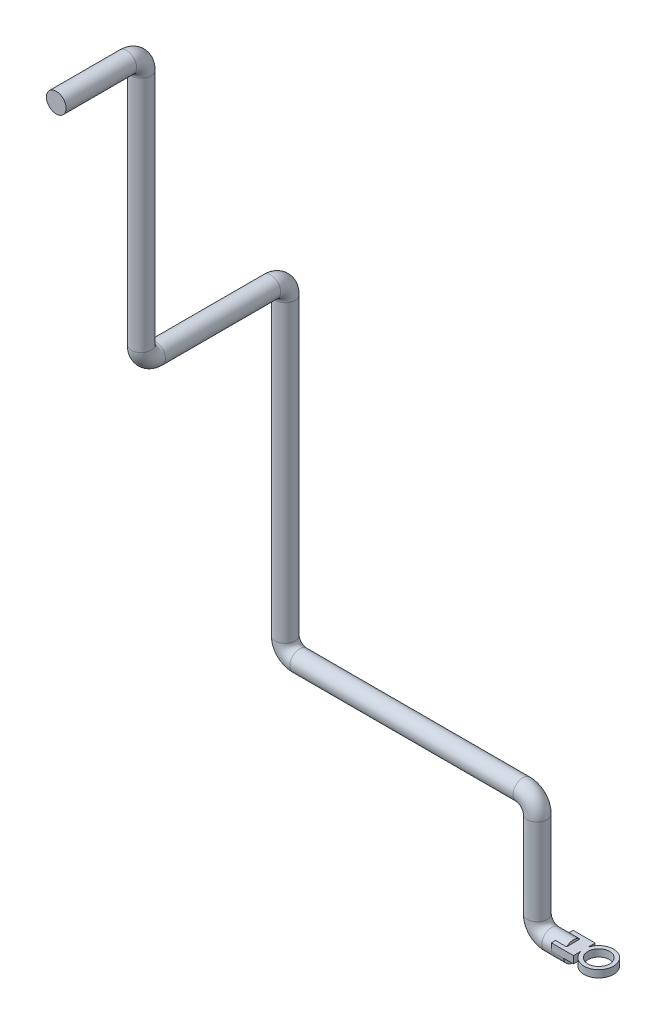
ISO-10303-21;
HEADER;
FILE_DESCRIPTION(('STEP AP214'),'2;1');
FILE_NAME('part.step','',(''),(''),'','','');
FILE_SCHEMA(('AUTOMOTIVE_DESIGN { 1 0 10303 214 1 1 1 1 }'));
ENDSEC;
DATA;
#1=APPLICATION_CONTEXT('core data for automotive mechanical design processes');
#2=APPLICATION_PROTOCOL_DEFINITION('international standard','automotive_design',2000,#1);
#3=PRODUCT_CONTEXT('',#1,'mechanical');
#4=PRODUCT('Part','Part','',(#3));
#5=PRODUCT_RELATED_PRODUCT_CATEGORY('part','',(#4));
#6=PRODUCT_DEFINITION_FORMATION('','',#4);
#7=PRODUCT_DEFINITION_CONTEXT('part definition',#1,'design');
#8=PRODUCT_DEFINITION('design','',#6,#7);
#9=PRODUCT_DEFINITION_SHAPE('','',#8);
#10=(LENGTH_UNIT() NAMED_UNIT(*) SI_UNIT(.MILLI.,.METRE.));
#11=(NAMED_UNIT(*) PLANE_ANGLE_UNIT() SI_UNIT($,.RADIAN.));
#12=(NAMED_UNIT(*) SI_UNIT($,.STERADIAN.) SOLID_ANGLE_UNIT());
#13=UNCERTAINTY_MEASURE_WITH_UNIT(LENGTH_MEASURE(1.E-05),#10,'distance_accuracy_value','');
#14=(GEOMETRIC_REPRESENTATION_CONTEXT(3) GLOBAL_UNCERTAINTY_ASSIGNED_CONTEXT((#13)) GLOBAL_UNIT_ASSIGNED_CONTEXT((#10,
#11,#12)) REPRESENTATION_CONTEXT('',''));
#15=CARTESIAN_POINT('',(0.,0.,0.));
#16=DIRECTION('',(0.,0.,1.));
#17=DIRECTION('',(1.,0.,0.));
#18=AXIS2_PLACEMENT_3D('',#15,#16,#17);
#19=CARTESIAN_POINT('',(0.,0.,0.));
#20=DIRECTION('',(1.,0.,0.));
#21=DIRECTION('',(0.,0.,-1.));
#22=AXIS2_PLACEMENT_3D('',#19,#20,#21);
#23=PLANE('',#22);
#24=CARTESIAN_POINT('',(0.,0.,0.));
#25=DIRECTION('',(1.,0.,0.));
#26=DIRECTION('',(0.,0.,-1.));
#27=AXIS2_PLACEMENT_3D('',#24,#25,#26);
#28=CIRCLE('',#27,13.7);
#29=CARTESIAN_POINT('',(0.,0.,13.7));
#30=VERTEX_POINT('',#29);
#31=CARTESIAN_POINT('',(0.,0.,-13.7));
#32=VERTEX_POINT('',#31);
#33=EDGE_CURVE('E185',#30,#32,#28,.T.);
#34=ORIENTED_EDGE('',*,*,#33,.T.);
#35=DIRECTION('',(0.,0.,1.));
#36=VECTOR('',#35,1.);
#37=CARTESIAN_POINT('',(0.,0.,0.));
#38=LINE('',#37,#36);
#39=EDGE_CURVE('E122',#32,#30,#38,.T.);
#40=ORIENTED_EDGE('',*,*,#39,.T.);
#41=EDGE_LOOP('',(#34,#40));
#42=FACE_BOUND('',#41,.T.);
#43=ADVANCED_FACE('F36',(#42),#23,.T.);
#44=DIRECTION('',(0.,0.,1.));
#45=VECTOR('',#44,1.);
#46=CARTESIAN_POINT('',(0.,10.,0.));
#47=LINE('',#46,#45);
#48=CARTESIAN_POINT('',(0.,10.,-9.36429388688757));
#49=VERTEX_POINT('',#48);
#50=CARTESIAN_POINT('',(0.,10.,9.36429388688757));
#51=VERTEX_POINT('',#50);
#52=EDGE_CURVE('E182',#49,#51,#47,.T.);
#53=ORIENTED_EDGE('',*,*,#52,.F.);
#54=EDGE_CURVE('E188',#49,#51,#28,.T.);
#55=ORIENTED_EDGE('',*,*,#54,.T.);
#56=EDGE_LOOP('',(#53,#55));
#57=FACE_BOUND('',#56,.T.);
#58=ADVANCED_FACE('F38',(#57),#23,.T.);
#59=CARTESIAN_POINT('',(-400.,979.49,318.));
#60=DIRECTION('',(0.,0.,-1.));
#61=DIRECTION('',(0.,1.,0.));
#62=AXIS2_PLACEMENT_3D('',#59,#60,#61);
#63=PLANE('',#62);
#64=CARTESIAN_POINT('',(-400.,979.49,318.));
#65=DIRECTION('',(0.,0.,-1.));
#66=DIRECTION('',(0.,1.,0.));
#67=AXIS2_PLACEMENT_3D('',#64,#65,#66);
#68=CIRCLE('',#67,13.7);
#69=CARTESIAN_POINT('',(-400.,993.19,318.));
#70=VERTEX_POINT('',#69);
#71=EDGE_CURVE('E225',#70,#70,#68,.T.);
#72=ORIENTED_EDGE('',*,*,#71,.F.);
#73=EDGE_LOOP('',(#72));
#74=FACE_BOUND('',#73,.T.);
#75=ADVANCED_FACE('F271',(#74),#63,.F.);
#76=CARTESIAN_POINT('',(0.,0.,0.));
#77=DIRECTION('',(-1.,0.,0.));
#78=DIRECTION('',(0.,0.,1.));
#79=AXIS2_PLACEMENT_3D('',#76,#77,#78);
#80=CYLINDRICAL_SURFACE('',#79,13.7);
#81=CARTESIAN_POINT('',(-30.,0.,0.));
#82=DIRECTION('',(1.,0.,0.));
#83=DIRECTION('',(0.,0.,-1.));
#84=AXIS2_PLACEMENT_3D('',#81,#82,#83);
#85=CIRCLE('',#84,13.7);
#86=CARTESIAN_POINT('',(-30.,-13.7,0.));
#87=VERTEX_POINT('',#86);
#88=EDGE_CURVE('E189',#87,#87,#85,.T.);
#89=ORIENTED_EDGE('',*,*,#88,.T.);
#90=EDGE_LOOP('',(#89));
#91=FACE_BOUND('',#90,.T.);
#92=ORIENTED_EDGE('',*,*,#54,.F.);
#93=DIRECTION('',(-1.,0.,0.));
#94=VECTOR('',#93,1.);
#95=CARTESIAN_POINT('',(0.,10.,-9.36429388688757));
#96=LINE('',#95,#94);
#97=CARTESIAN_POINT('',(-15.3221245920195,10.,-9.36429388688757));
#98=VERTEX_POINT('',#97);
#99=EDGE_CURVE('E11',#49,#98,#96,.T.);
#100=ORIENTED_EDGE('',*,*,#99,.T.);
#101=CARTESIAN_POINT('',(-15.3221245920195,0.,0.));
#102=DIRECTION('',(1.,0.,0.));
#103=DIRECTION('',(0.,0.,-1.));
#104=AXIS2_PLACEMENT_3D('',#101,#102,#103);
#105=CIRCLE('',#104,13.7);
#106=CARTESIAN_POINT('',(-15.3221245920195,0.,-13.7));
#107=VERTEX_POINT('',#106);
#108=EDGE_CURVE('E44',#107,#98,#105,.T.);
#109=ORIENTED_EDGE('',*,*,#108,.F.);
#110=DIRECTION('',(-1.,0.,0.));
#111=VECTOR('',#110,1.);
#112=CARTESIAN_POINT('',(0.,0.,-13.7));
#113=LINE('',#112,#111);
#114=EDGE_CURVE('E234',#32,#107,#113,.T.);
#115=ORIENTED_EDGE('',*,*,#114,.F.);
#116=ORIENTED_EDGE('',*,*,#33,.F.);
#117=DIRECTION('',(-1.,0.,0.));
#118=VECTOR('',#117,1.);
#119=CARTESIAN_POINT('',(0.,0.,13.7));
#120=LINE('',#119,#118);
#121=CARTESIAN_POINT('',(-15.3221245920195,0.,13.7));
#122=VERTEX_POINT('',#121);
#123=EDGE_CURVE('E227',#122,#30,#120,.F.);
#124=ORIENTED_EDGE('',*,*,#123,.F.);
#125=CARTESIAN_POINT('',(-15.3221245920195,10.,9.36429388688757));
#126=VERTEX_POINT('',#125);
#127=EDGE_CURVE('E230',#126,#122,#105,.T.);
#128=ORIENTED_EDGE('',*,*,#127,.F.);
#129=DIRECTION('',(-1.,0.,0.));
#130=VECTOR('',#129,1.);
#131=CARTESIAN_POINT('',(0.,10.,9.36429388688757));
#132=LINE('',#131,#130);
#133=EDGE_CURVE('E233',#126,#51,#132,.F.);
#134=ORIENTED_EDGE('',*,*,#133,.T.);
#135=EDGE_LOOP('',(#92,#100,#109,#115,#116,#124,#128,#134));
#136=FACE_BOUND('',#135,.T.);
#137=ADVANCED_FACE('F245',(#91,#136),#80,.T.);
#138=CARTESIAN_POINT('',(-30.,20.,0.));
#139=DIRECTION('',(0.,0.,-1.));
#140=DIRECTION('',(-1.,0.,0.));
#141=AXIS2_PLACEMENT_3D('',#138,#139,#140);
#142=TOROIDAL_SURFACE('',#141,20.,13.7);
#143=CARTESIAN_POINT('',(-50.,20.,0.));
#144=DIRECTION('',(0.,-1.,0.));
#145=DIRECTION('',(0.,0.,-1.));
#146=AXIS2_PLACEMENT_3D('',#143,#144,#145);
#147=CIRCLE('',#146,13.7);
#148=CARTESIAN_POINT('',(-63.7,20.,0.));
#149=VERTEX_POINT('',#148);
#150=EDGE_CURVE('E192',#149,#149,#147,.T.);
#151=CARTESIAN_POINT('',(-30.,20.,0.));
#152=DIRECTION('',(0.,0.,-1.));
#153=DIRECTION('',(-1.,0.,0.));
#154=AXIS2_PLACEMENT_3D('',#151,#152,#153);
#155=CIRCLE('',#154,33.7);
#156=EDGE_CURVE('',#87,#149,#155,.T.);
#157=ORIENTED_EDGE('',*,*,#88,.F.);
#158=ORIENTED_EDGE('',*,*,#150,.T.);
#159=ORIENTED_EDGE('',*,*,#156,.T.);
#160=ORIENTED_EDGE('',*,*,#156,.F.);
#161=EDGE_LOOP('',(#157,#159,#158,#160));
#162=FACE_BOUND('',#161,.T.);
#163=ADVANCED_FACE('F290',(#162),#142,.T.);
#164=CARTESIAN_POINT('',(-50.,20.,0.));
#165=DIRECTION('',(0.,1.,0.));
#166=DIRECTION('',(0.,0.,1.));
#167=AXIS2_PLACEMENT_3D('',#164,#165,#166);
#168=CYLINDRICAL_SURFACE('',#167,13.7);
#169=CARTESIAN_POINT('',(-50.,140.,0.));
#170=DIRECTION('',(0.,-1.,0.));
#171=DIRECTION('',(0.,0.,-1.));
#172=AXIS2_PLACEMENT_3D('',#169,#170,#171);
#173=CIRCLE('',#172,13.7);
#174=CARTESIAN_POINT('',(-36.3,140.,0.));
#175=VERTEX_POINT('',#174);
#176=EDGE_CURVE('E195',#175,#175,#173,.T.);
#177=ORIENTED_EDGE('',*,*,#176,.T.);
#178=EDGE_LOOP('',(#177));
#179=FACE_BOUND('',#178,.T.);
#180=ORIENTED_EDGE('',*,*,#150,.F.);
#181=EDGE_LOOP('',(#180));
#182=FACE_BOUND('',#181,.T.);
#183=ADVANCED_FACE('F297',(#179,#182),#168,.T.);
#184=CARTESIAN_POINT('',(-70.,140.,0.));
#185=DIRECTION('',(0.,0.,1.));
#186=DIRECTION('',(1.,0.,0.));
#187=AXIS2_PLACEMENT_3D('',#184,#185,#186);
#188=TOROIDAL_SURFACE('',#187,20.,13.7);
#189=CARTESIAN_POINT('',(-70.,160.,0.));
#190=DIRECTION('',(1.,0.,0.));
#191=DIRECTION('',(0.,0.,-1.));
#192=AXIS2_PLACEMENT_3D('',#189,#190,#191);
#193=CIRCLE('',#192,13.7);
#194=CARTESIAN_POINT('',(-70.,173.7,0.));
#195=VERTEX_POINT('',#194);
#196=EDGE_CURVE('E198',#195,#195,#193,.T.);
#197=CARTESIAN_POINT('',(-70.,140.,0.));
#198=DIRECTION('',(0.,0.,1.));
#199=DIRECTION('',(1.,0.,0.));
#200=AXIS2_PLACEMENT_3D('',#197,#198,#199);
#201=CIRCLE('',#200,33.7);
#202=EDGE_CURVE('',#175,#195,#201,.T.);
#203=ORIENTED_EDGE('',*,*,#176,.F.);
#204=ORIENTED_EDGE('',*,*,#196,.T.);
#205=ORIENTED_EDGE('',*,*,#202,.T.);
#206=ORIENTED_EDGE('',*,*,#202,.F.);
#207=EDGE_LOOP('',(#203,#205,#204,#206));
#208=FACE_BOUND('',#207,.T.);
#209=ADVANCED_FACE('F305',(#208),#188,.T.);
#210=CARTESIAN_POINT('',(-70.,160.,0.));
#211=DIRECTION('',(-1.,0.,0.));
#212=DIRECTION('',(0.,0.,1.));
#213=AXIS2_PLACEMENT_3D('',#210,#211,#212);
#214=CYLINDRICAL_SURFACE('',#213,13.7);
#215=CARTESIAN_POINT('',(-380.,160.,0.));
#216=DIRECTION('',(1.,0.,0.));
#217=DIRECTION('',(0.,0.,-1.));
#218=AXIS2_PLACEMENT_3D('',#215,#216,#217);
#219=CIRCLE('',#218,13.7);
#220=CARTESIAN_POINT('',(-380.,146.3,0.));
#221=VERTEX_POINT('',#220);
#222=EDGE_CURVE('E201',#221,#221,#219,.T.);
#223=ORIENTED_EDGE('',*,*,#222,.T.);
#224=EDGE_LOOP('',(#223));
#225=FACE_BOUND('',#224,.T.);
#226=ORIENTED_EDGE('',*,*,#196,.F.);
#227=EDGE_LOOP('',(#226));
#228=FACE_BOUND('',#227,.T.);
#229=ADVANCED_FACE('F309',(#225,#228),#214,.T.);
#230=CARTESIAN_POINT('',(-380.,180.,0.));
#231=DIRECTION('',(0.,0.,-1.));
#232=DIRECTION('',(-1.,0.,0.));
#233=AXIS2_PLACEMENT_3D('',#230,#231,#232);
#234=TOROIDAL_SURFACE('',#233,20.,13.7);
#235=CARTESIAN_POINT('',(-400.,180.,0.));
#236=DIRECTION('',(0.,-1.,0.));
#237=DIRECTION('',(0.,0.,-1.));
#238=AXIS2_PLACEMENT_3D('',#235,#236,#237);
#239=CIRCLE('',#238,13.7);
#240=CARTESIAN_POINT('',(-413.7,180.,0.));
#241=VERTEX_POINT('',#240);
#242=EDGE_CURVE('E204',#241,#241,#239,.T.);
#243=CARTESIAN_POINT('',(-380.,180.,0.));
#244=DIRECTION('',(0.,0.,-1.));
#245=DIRECTION('',(-1.,0.,0.));
#246=AXIS2_PLACEMENT_3D('',#243,#244,#245);
#247=CIRCLE('',#246,33.7);
#248=EDGE_CURVE('',#221,#241,#247,.T.);
#249=ORIENTED_EDGE('',*,*,#222,.F.);
#250=ORIENTED_EDGE('',*,*,#242,.T.);
#251=ORIENTED_EDGE('',*,*,#248,.T.);
#252=ORIENTED_EDGE('',*,*,#248,.F.);
#253=EDGE_LOOP('',(#249,#251,#250,#252));
#254=FACE_BOUND('',#253,.T.);
#255=ADVANCED_FACE('F313',(#254),#234,.T.);
#256=CARTESIAN_POINT('',(-400.,180.,0.));
#257=DIRECTION('',(0.,1.,0.));
#258=DIRECTION('',(0.,0.,1.));
#259=AXIS2_PLACEMENT_3D('',#256,#257,#258);
#260=CYLINDRICAL_SURFACE('',#259,13.7);
#261=CARTESIAN_POINT('',(-400.,589.49,0.));
#262=DIRECTION('',(0.,-1.,0.));
#263=DIRECTION('',(0.,0.,-1.));
#264=AXIS2_PLACEMENT_3D('',#261,#262,#263);
#265=CIRCLE('',#264,13.7);
#266=CARTESIAN_POINT('',(-400.,589.49,-13.7));
#267=VERTEX_POINT('',#266);
#268=EDGE_CURVE('E207',#267,#267,#265,.T.);
#269=ORIENTED_EDGE('',*,*,#268,.T.);
#270=EDGE_LOOP('',(#269));
#271=FACE_BOUND('',#270,.T.);
#272=ORIENTED_EDGE('',*,*,#242,.F.);
#273=EDGE_LOOP('',(#272));
#274=FACE_BOUND('',#273,.T.);
#275=ADVANCED_FACE('F317',(#271,#274),#260,.T.);
#276=CARTESIAN_POINT('',(-400.,589.49,20.));
#277=DIRECTION('',(1.,0.,0.));
#278=DIRECTION('',(0.,0.,-1.));
#279=AXIS2_PLACEMENT_3D('',#276,#277,#278);
#280=TOROIDAL_SURFACE('',#279,20.,13.7);
#281=CARTESIAN_POINT('',(-400.,609.49,20.));
#282=DIRECTION('',(0.,0.,-1.));
#283=DIRECTION('',(0.,1.,0.));
#284=AXIS2_PLACEMENT_3D('',#281,#282,#283);
#285=CIRCLE('',#284,13.7);
#286=CARTESIAN_POINT('',(-400.,623.19,20.));
#287=VERTEX_POINT('',#286);
#288=EDGE_CURVE('E210',#287,#287,#285,.T.);
#289=CARTESIAN_POINT('',(-400.,589.49,20.));
#290=DIRECTION('',(1.,0.,0.));
#291=DIRECTION('',(0.,0.,-1.));
#292=AXIS2_PLACEMENT_3D('',#289,#290,#291);
#293=CIRCLE('',#292,33.7);
#294=EDGE_CURVE('',#267,#287,#293,.T.);
#295=ORIENTED_EDGE('',*,*,#268,.F.);
#296=ORIENTED_EDGE('',*,*,#288,.T.);
#297=ORIENTED_EDGE('',*,*,#294,.T.);
#298=ORIENTED_EDGE('',*,*,#294,.F.);
#299=EDGE_LOOP('',(#295,#297,#296,#298));
#300=FACE_BOUND('',#299,.T.);
#301=ADVANCED_FACE('F321',(#300),#280,.T.);
#302=CARTESIAN_POINT('',(-400.,609.49,20.));
#303=DIRECTION('',(0.,0.,1.));
#304=DIRECTION('',(1.,0.,0.));
#305=AXIS2_PLACEMENT_3D('',#302,#303,#304);
#306=CYLINDRICAL_SURFACE('',#305,13.7);
#307=CARTESIAN_POINT('',(-400.,609.49,180.));
#308=DIRECTION('',(0.,0.,-1.));
#309=DIRECTION('',(0.,1.,0.));
#310=AXIS2_PLACEMENT_3D('',#307,#308,#309);
#311=CIRCLE('',#310,13.7);
#312=CARTESIAN_POINT('',(-400.,595.79,180.));
#313=VERTEX_POINT('',#312);
#314=EDGE_CURVE('E213',#313,#313,#311,.T.);
#315=ORIENTED_EDGE('',*,*,#314,.T.);
#316=EDGE_LOOP('',(#315));
#317=FACE_BOUND('',#316,.T.);
#318=ORIENTED_EDGE('',*,*,#288,.F.);
#319=EDGE_LOOP('',(#318));
#320=FACE_BOUND('',#319,.T.);
#321=ADVANCED_FACE('F325',(#317,#320),#306,.T.);
#322=CARTESIAN_POINT('',(-400.,629.49,180.));
#323=DIRECTION('',(-1.,0.,0.));
#324=DIRECTION('',(0.,0.,1.));
#325=AXIS2_PLACEMENT_3D('',#322,#323,#324);
#326=TOROIDAL_SURFACE('',#325,20.,13.7);
#327=CARTESIAN_POINT('',(-400.,629.49,200.));
#328=DIRECTION('',(0.,-1.,0.));
#329=DIRECTION('',(0.,0.,-1.));
#330=AXIS2_PLACEMENT_3D('',#327,#328,#329);
#331=CIRCLE('',#330,13.7);
#332=CARTESIAN_POINT('',(-400.,629.49,213.7));
#333=VERTEX_POINT('',#332);
#334=EDGE_CURVE('E216',#333,#333,#331,.T.);
#335=CARTESIAN_POINT('',(-400.,629.49,180.));
#336=DIRECTION('',(-1.,0.,0.));
#337=DIRECTION('',(0.,0.,1.));
#338=AXIS2_PLACEMENT_3D('',#335,#336,#337);
#339=CIRCLE('',#338,33.7);
#340=EDGE_CURVE('',#313,#333,#339,.T.);
#341=ORIENTED_EDGE('',*,*,#314,.F.);
#342=ORIENTED_EDGE('',*,*,#334,.T.);
#343=ORIENTED_EDGE('',*,*,#340,.T.);
#344=ORIENTED_EDGE('',*,*,#340,.F.);
#345=EDGE_LOOP('',(#341,#343,#342,#344));
#346=FACE_BOUND('',#345,.T.);
#347=ADVANCED_FACE('F329',(#346),#326,.T.);
#348=CARTESIAN_POINT('',(-400.,629.49,200.));
#349=DIRECTION('',(0.,1.,0.));
#350=DIRECTION('',(0.,0.,1.));
#351=AXIS2_PLACEMENT_3D('',#348,#349,#350);
#352=CYLINDRICAL_SURFACE('',#351,13.7);
#353=CARTESIAN_POINT('',(-400.,959.49,200.));
#354=DIRECTION('',(0.,-1.,0.));
#355=DIRECTION('',(0.,0.,-1.));
#356=AXIS2_PLACEMENT_3D('',#353,#354,#355);
#357=CIRCLE('',#356,13.7);
#358=CARTESIAN_POINT('',(-400.,959.49,186.3));
#359=VERTEX_POINT('',#358);
#360=EDGE_CURVE('E219',#359,#359,#357,.T.);
#361=ORIENTED_EDGE('',*,*,#360,.T.);
#362=EDGE_LOOP('',(#361));
#363=FACE_BOUND('',#362,.T.);
#364=ORIENTED_EDGE('',*,*,#334,.F.);
#365=EDGE_LOOP('',(#364));
#366=FACE_BOUND('',#365,.T.);
#367=ADVANCED_FACE('F280',(#363,#366),#352,.T.);
#368=CARTESIAN_POINT('',(-400.,959.49,220.));
#369=DIRECTION('',(1.,0.,0.));
#370=DIRECTION('',(0.,0.,-1.));
#371=AXIS2_PLACEMENT_3D('',#368,#369,#370);
#372=TOROIDAL_SURFACE('',#371,20.,13.7);
#373=CARTESIAN_POINT('',(-400.,979.49,220.));
#374=DIRECTION('',(0.,0.,-1.));
#375=DIRECTION('',(0.,1.,0.));
#376=AXIS2_PLACEMENT_3D('',#373,#374,#375);
#377=CIRCLE('',#376,13.7);
#378=CARTESIAN_POINT('',(-400.,993.19,220.));
#379=VERTEX_POINT('',#378);
#380=EDGE_CURVE('E222',#379,#379,#377,.T.);
#381=CARTESIAN_POINT('',(-400.,959.49,220.));
#382=DIRECTION('',(1.,0.,0.));
#383=DIRECTION('',(0.,0.,-1.));
#384=AXIS2_PLACEMENT_3D('',#381,#382,#383);
#385=CIRCLE('',#384,33.7);
#386=EDGE_CURVE('',#359,#379,#385,.T.);
#387=ORIENTED_EDGE('',*,*,#360,.F.);
#388=ORIENTED_EDGE('',*,*,#380,.T.);
#389=ORIENTED_EDGE('',*,*,#386,.T.);
#390=ORIENTED_EDGE('',*,*,#386,.F.);
#391=EDGE_LOOP('',(#387,#389,#388,#390));
#392=FACE_BOUND('',#391,.T.);
#393=ADVANCED_FACE('F273',(#392),#372,.T.);
#394=CARTESIAN_POINT('',(-400.,979.49,220.));
#395=DIRECTION('',(0.,0.,1.));
#396=DIRECTION('',(1.,0.,0.));
#397=AXIS2_PLACEMENT_3D('',#394,#395,#396);
#398=CYLINDRICAL_SURFACE('',#397,13.7);
#399=ORIENTED_EDGE('',*,*,#71,.T.);
#400=EDGE_LOOP('',(#399));
#401=FACE_BOUND('',#400,.T.);
#402=ORIENTED_EDGE('',*,*,#380,.F.);
#403=EDGE_LOOP('',(#402));
#404=FACE_BOUND('',#403,.T.);
#405=ADVANCED_FACE('F267',(#401,#404),#398,.T.);
#406=CARTESIAN_POINT('',(-15.3221245920195,10.,0.));
#407=DIRECTION('',(1.,0.,0.));
#408=DIRECTION('',(0.,0.,-1.));
#409=AXIS2_PLACEMENT_3D('',#406,#407,#408);
#410=PLANE('',#409);
#411=DIRECTION('',(0.,0.,1.));
#412=VECTOR('',#411,1.);
#413=CARTESIAN_POINT('',(-15.3221245920195,0.,0.));
#414=LINE('',#413,#412);
#415=CARTESIAN_POINT('',(-15.3221245920195,0.,-15.0733030072421));
#416=VERTEX_POINT('',#415);
#417=EDGE_CURVE('E166',#416,#107,#414,.T.);
#418=ORIENTED_EDGE('',*,*,#417,.T.);
#419=ORIENTED_EDGE('',*,*,#108,.T.);
#420=DIRECTION('',(0.,0.,1.));
#421=VECTOR('',#420,1.);
#422=CARTESIAN_POINT('',(-15.3221245920195,10.,0.));
#423=LINE('',#422,#421);
#424=CARTESIAN_POINT('',(-15.3221245920195,10.,-15.0733030072421));
#425=VERTEX_POINT('',#424);
#426=EDGE_CURVE('E149',#425,#98,#423,.T.);
#427=ORIENTED_EDGE('',*,*,#426,.F.);
#428=DIRECTION('',(0.,-1.,0.));
#429=VECTOR('',#428,1.);
#430=CARTESIAN_POINT('',(-15.3221245920195,10.,-15.0733030072421));
#431=LINE('',#430,#429);
#432=EDGE_CURVE('E175',#425,#416,#431,.T.);
#433=ORIENTED_EDGE('',*,*,#432,.T.);
#434=EDGE_LOOP('',(#418,#419,#427,#433));
#435=FACE_BOUND('',#434,.T.);
#436=ADVANCED_FACE('F240',(#435),#410,.F.);
#437=CARTESIAN_POINT('',(0.,10.,0.));
#438=DIRECTION('',(0.,1.,0.));
#439=DIRECTION('',(0.,0.,1.));
#440=AXIS2_PLACEMENT_3D('',#437,#438,#439);
#441=PLANE('',#440);
#442=CARTESIAN_POINT('',(35.3357830316579,10.,0.));
#443=DIRECTION('',(0.,1.,0.));
#444=DIRECTION('',(0.,0.,1.));
#445=AXIS2_PLACEMENT_3D('',#442,#443,#444);
#446=CIRCLE('',#445,15.0733030072421);
#447=CARTESIAN_POINT('',(35.3357830316579,10.,15.0733030072421));
#448=VERTEX_POINT('',#447);
#449=EDGE_CURVE('E154',#448,#448,#446,.T.);
#450=ORIENTED_EDGE('',*,*,#449,.F.);
#451=EDGE_LOOP('',(#450));
#452=FACE_BOUND('',#451,.T.);
#453=ORIENTED_EDGE('',*,*,#99,.F.);
#454=ORIENTED_EDGE('',*,*,#52,.T.);
#455=ORIENTED_EDGE('',*,*,#133,.F.);
#456=CARTESIAN_POINT('',(-15.3221245920195,10.,15.0733030072421));
#457=VERTEX_POINT('',#456);
#458=EDGE_CURVE('E145',#126,#457,#423,.T.);
#459=ORIENTED_EDGE('',*,*,#458,.T.);
#460=DIRECTION('',(1.,0.,0.));
#461=VECTOR('',#460,1.);
#462=CARTESIAN_POINT('',(0.,10.,15.0733030072421));
#463=LINE('',#462,#461);
#464=CARTESIAN_POINT('',(15.3221245920195,10.,15.0733030072421));
#465=VERTEX_POINT('',#464);
#466=EDGE_CURVE('E135',#457,#465,#463,.T.);
#467=ORIENTED_EDGE('',*,*,#466,.T.);
#468=DIRECTION('',(0.,0.,1.));
#469=VECTOR('',#468,1.);
#470=CARTESIAN_POINT('',(15.3221245920195,10.,0.));
#471=LINE('',#470,#469);
#472=CARTESIAN_POINT('',(15.3221245920195,10.,4.51137830252698));
#473=VERTEX_POINT('',#472);
#474=EDGE_CURVE('E116',#473,#465,#471,.T.);
#475=ORIENTED_EDGE('',*,*,#474,.F.);
#476=CARTESIAN_POINT('',(35.3357830316579,10.,0.));
#477=DIRECTION('',(0.,1.,0.));
#478=DIRECTION('',(0.,0.,1.));
#479=AXIS2_PLACEMENT_3D('',#476,#477,#478);
#480=CIRCLE('',#479,20.5158245831608);
#481=CARTESIAN_POINT('',(15.3221245920195,10.,-4.51137830252698));
#482=VERTEX_POINT('',#481);
#483=EDGE_CURVE('E126',#473,#482,#480,.T.);
#484=ORIENTED_EDGE('',*,*,#483,.T.);
#485=CARTESIAN_POINT('',(15.3221245920195,10.,-15.0733030072421));
#486=VERTEX_POINT('',#485);
#487=EDGE_CURVE('E131',#486,#482,#471,.T.);
#488=ORIENTED_EDGE('',*,*,#487,.F.);
#489=DIRECTION('',(1.,0.,0.));
#490=VECTOR('',#489,1.);
#491=CARTESIAN_POINT('',(0.,10.,-15.0733030072421));
#492=LINE('',#491,#490);
#493=EDGE_CURVE('E142',#425,#486,#492,.T.);
#494=ORIENTED_EDGE('',*,*,#493,.F.);
#495=ORIENTED_EDGE('',*,*,#426,.T.);
#496=EDGE_LOOP('',(#453,#454,#455,#459,#467,#475,#484,#488,#494,#495));
#497=FACE_BOUND('',#496,.T.);
#498=ADVANCED_FACE('F133',(#452,#497),#441,.T.);
#499=CARTESIAN_POINT('',(0.,0.,0.));
#500=DIRECTION('',(0.,1.,0.));
#501=DIRECTION('',(0.,0.,1.));
#502=AXIS2_PLACEMENT_3D('',#499,#500,#501);
#503=PLANE('',#502);
#504=CARTESIAN_POINT('',(35.3357830316579,0.,0.));
#505=DIRECTION('',(0.,1.,0.));
#506=DIRECTION('',(0.,0.,1.));
#507=AXIS2_PLACEMENT_3D('',#504,#505,#506);
#508=CIRCLE('',#507,15.0733030072421);
#509=CARTESIAN_POINT('',(35.3357830316579,0.,15.0733030072421));
#510=VERTEX_POINT('',#509);
#511=EDGE_CURVE('E137',#510,#510,#508,.T.);
#512=ORIENTED_EDGE('',*,*,#511,.T.);
#513=EDGE_LOOP('',(#512));
#514=FACE_BOUND('',#513,.T.);
#515=ORIENTED_EDGE('',*,*,#39,.F.);
#516=ORIENTED_EDGE('',*,*,#114,.T.);
#517=ORIENTED_EDGE('',*,*,#417,.F.);
#518=DIRECTION('',(1.,0.,0.));
#519=VECTOR('',#518,1.);
#520=CARTESIAN_POINT('',(0.,0.,-15.0733030072421));
#521=LINE('',#520,#519);
#522=CARTESIAN_POINT('',(15.3221245920195,0.,-15.0733030072421));
#523=VERTEX_POINT('',#522);
#524=EDGE_CURVE('E162',#416,#523,#521,.T.);
#525=ORIENTED_EDGE('',*,*,#524,.T.);
#526=DIRECTION('',(0.,0.,1.));
#527=VECTOR('',#526,1.);
#528=CARTESIAN_POINT('',(15.3221245920195,0.,0.));
#529=LINE('',#528,#527);
#530=CARTESIAN_POINT('',(15.3221245920195,0.,-4.51137830252698));
#531=VERTEX_POINT('',#530);
#532=EDGE_CURVE('E160',#523,#531,#529,.T.);
#533=ORIENTED_EDGE('',*,*,#532,.T.);
#534=CARTESIAN_POINT('',(35.3357830316579,0.,0.));
#535=DIRECTION('',(0.,1.,0.));
#536=DIRECTION('',(0.,0.,1.));
#537=AXIS2_PLACEMENT_3D('',#534,#535,#536);
#538=CIRCLE('',#537,20.5158245831608);
#539=CARTESIAN_POINT('',(15.3221245920195,0.,4.51137830252698));
#540=VERTEX_POINT('',#539);
#541=EDGE_CURVE('E159',#540,#531,#538,.T.);
#542=ORIENTED_EDGE('',*,*,#541,.F.);
#543=CARTESIAN_POINT('',(15.3221245920195,0.,15.0733030072421));
#544=VERTEX_POINT('',#543);
#545=EDGE_CURVE('E118',#540,#544,#529,.T.);
#546=ORIENTED_EDGE('',*,*,#545,.T.);
#547=DIRECTION('',(1.,0.,0.));
#548=VECTOR('',#547,1.);
#549=CARTESIAN_POINT('',(0.,0.,15.0733030072421));
#550=LINE('',#549,#548);
#551=CARTESIAN_POINT('',(-15.3221245920195,0.,15.0733030072421));
#552=VERTEX_POINT('',#551);
#553=EDGE_CURVE('E140',#552,#544,#550,.T.);
#554=ORIENTED_EDGE('',*,*,#553,.F.);
#555=EDGE_CURVE('E165',#122,#552,#414,.T.);
#556=ORIENTED_EDGE('',*,*,#555,.F.);
#557=ORIENTED_EDGE('',*,*,#123,.T.);
#558=EDGE_LOOP('',(#515,#516,#517,#525,#533,#542,#546,#554,#556,#557));
#559=FACE_BOUND('',#558,.T.);
#560=ADVANCED_FACE('F251',(#514,#559),#503,.F.);
#561=CARTESIAN_POINT('',(15.3221245920195,10.,0.));
#562=DIRECTION('',(1.,0.,0.));
#563=DIRECTION('',(0.,0.,-1.));
#564=AXIS2_PLACEMENT_3D('',#561,#562,#563);
#565=PLANE('',#564);
#566=ORIENTED_EDGE('',*,*,#545,.F.);
#567=DIRECTION('',(0.,-1.,0.));
#568=VECTOR('',#567,1.);
#569=CARTESIAN_POINT('',(15.3221245920195,10.,4.51137830252698));
#570=LINE('',#569,#568);
#571=EDGE_CURVE('E112',#473,#540,#570,.T.);
#572=ORIENTED_EDGE('',*,*,#571,.F.);
#573=ORIENTED_EDGE('',*,*,#474,.T.);
#574=DIRECTION('',(0.,-1.,0.));
#575=VECTOR('',#574,1.);
#576=CARTESIAN_POINT('',(15.3221245920195,10.,15.0733030072421));
#577=LINE('',#576,#575);
#578=EDGE_CURVE('E157',#465,#544,#577,.T.);
#579=ORIENTED_EDGE('',*,*,#578,.T.);
#580=EDGE_LOOP('',(#566,#572,#573,#579));
#581=FACE_BOUND('',#580,.T.);
#582=ADVANCED_FACE('F114',(#581),#565,.T.);
#583=CARTESIAN_POINT('',(35.3357830316579,10.,0.));
#584=DIRECTION('',(0.,-1.,0.));
#585=DIRECTION('',(0.,0.,-1.));
#586=AXIS2_PLACEMENT_3D('',#583,#584,#585);
#587=CYLINDRICAL_SURFACE('',#586,20.5158245831608);
#588=ORIENTED_EDGE('',*,*,#541,.T.);
#589=DIRECTION('',(0.,-1.,0.));
#590=VECTOR('',#589,1.);
#591=CARTESIAN_POINT('',(15.3221245920195,10.,-4.51137830252698));
#592=LINE('',#591,#590);
#593=EDGE_CURVE('E123',#482,#531,#592,.T.);
#594=ORIENTED_EDGE('',*,*,#593,.F.);
#595=ORIENTED_EDGE('',*,*,#483,.F.);
#596=ORIENTED_EDGE('',*,*,#571,.T.);
#597=EDGE_LOOP('',(#588,#594,#595,#596));
#598=FACE_BOUND('',#597,.T.);
#599=ADVANCED_FACE('F127',(#598),#587,.T.);
#600=ORIENTED_EDGE('',*,*,#532,.F.);
#601=DIRECTION('',(0.,-1.,0.));
#602=VECTOR('',#601,1.);
#603=CARTESIAN_POINT('',(15.3221245920195,10.,-15.0733030072421));
#604=LINE('',#603,#602);
#605=EDGE_CURVE('E177',#486,#523,#604,.T.);
#606=ORIENTED_EDGE('',*,*,#605,.F.);
#607=ORIENTED_EDGE('',*,*,#487,.T.);
#608=ORIENTED_EDGE('',*,*,#593,.T.);
#609=EDGE_LOOP('',(#600,#606,#607,#608));
#610=FACE_BOUND('',#609,.T.);
#611=ADVANCED_FACE('F423',(#610),#565,.T.);
#612=CARTESIAN_POINT('',(0.,10.,-15.0733030072421));
#613=DIRECTION('',(0.,0.,-1.));
#614=DIRECTION('',(-1.,0.,0.));
#615=AXIS2_PLACEMENT_3D('',#612,#613,#614);
#616=PLANE('',#615);
#617=ORIENTED_EDGE('',*,*,#524,.F.);
#618=ORIENTED_EDGE('',*,*,#432,.F.);
#619=ORIENTED_EDGE('',*,*,#493,.T.);
#620=ORIENTED_EDGE('',*,*,#605,.T.);
#621=EDGE_LOOP('',(#617,#618,#619,#620));
#622=FACE_BOUND('',#621,.T.);
#623=ADVANCED_FACE('F263',(#622),#616,.T.);
#624=ORIENTED_EDGE('',*,*,#458,.F.);
#625=ORIENTED_EDGE('',*,*,#127,.T.);
#626=ORIENTED_EDGE('',*,*,#555,.T.);
#627=DIRECTION('',(0.,-1.,0.));
#628=VECTOR('',#627,1.);
#629=CARTESIAN_POINT('',(-15.3221245920195,10.,15.0733030072421));
#630=LINE('',#629,#628);
#631=EDGE_CURVE('E172',#457,#552,#630,.T.);
#632=ORIENTED_EDGE('',*,*,#631,.F.);
#633=EDGE_LOOP('',(#624,#625,#626,#632));
#634=FACE_BOUND('',#633,.T.);
#635=ADVANCED_FACE('F248',(#634),#410,.F.);
#636=CARTESIAN_POINT('',(0.,10.,15.0733030072421));
#637=DIRECTION('',(0.,0.,-1.));
#638=DIRECTION('',(-1.,0.,0.));
#639=AXIS2_PLACEMENT_3D('',#636,#637,#638);
#640=PLANE('',#639);
#641=ORIENTED_EDGE('',*,*,#553,.T.);
#642=ORIENTED_EDGE('',*,*,#578,.F.);
#643=ORIENTED_EDGE('',*,*,#466,.F.);
#644=ORIENTED_EDGE('',*,*,#631,.T.);
#645=EDGE_LOOP('',(#641,#642,#643,#644));
#646=FACE_BOUND('',#645,.T.);
#647=ADVANCED_FACE('F253',(#646),#640,.F.);
#648=CARTESIAN_POINT('',(35.3357830316579,10.,0.));
#649=DIRECTION('',(0.,-1.,0.));
#650=DIRECTION('',(0.,0.,-1.));
#651=AXIS2_PLACEMENT_3D('',#648,#649,#650);
#652=CYLINDRICAL_SURFACE('',#651,15.0733030072421);
#653=ORIENTED_EDGE('',*,*,#449,.T.);
#654=EDGE_LOOP('',(#653));
#655=FACE_BOUND('',#654,.T.);
#656=ORIENTED_EDGE('',*,*,#511,.F.);
#657=EDGE_LOOP('',(#656));
#658=FACE_BOUND('',#657,.T.);
#659=ADVANCED_FACE('F255',(#655,#658),#652,.F.);
#660=CLOSED_SHELL('',(#43,#58,#75,#137,#163,#183,#209,#229,#255,#275,#301,#321,#347,#367,#393,
#405,#436,#498,#560,#582,#599,#611,#623,#635,#647,#659));
#661=MANIFOLD_SOLID_BREP('B2',#660);
#662=ADVANCED_BREP_SHAPE_REPRESENTATION('',(#18,#661),#14);
#663=SHAPE_DEFINITION_REPRESENTATION(#9,#662);
ENDSEC;
END-ISO-10303-21;
